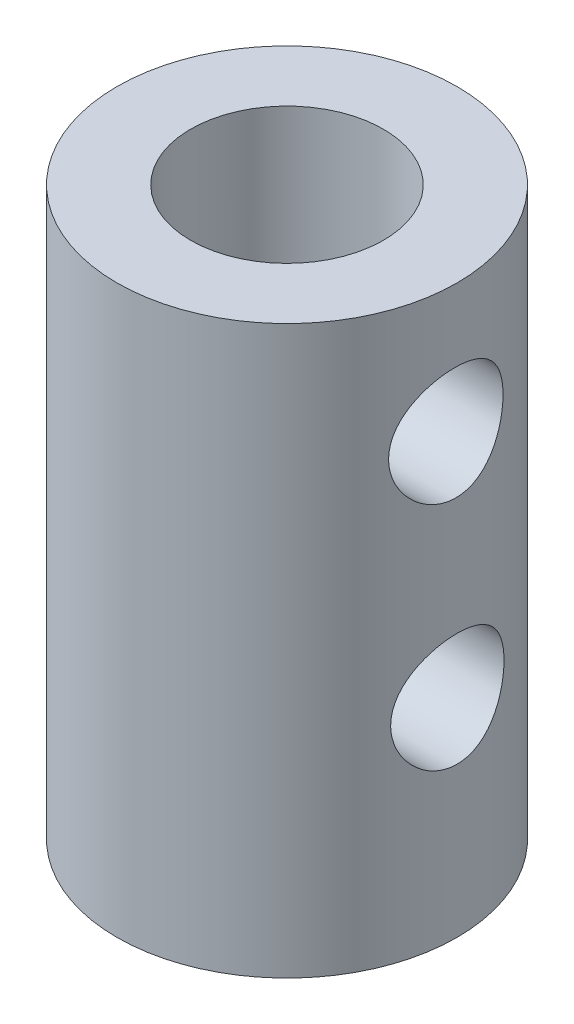
ISO-10303-21;
HEADER;
FILE_DESCRIPTION(('STEP AP214'),'2;1');
FILE_NAME('part.step','',(''),(''),'','','');
FILE_SCHEMA(('AUTOMOTIVE_DESIGN { 1 0 10303 214 1 1 1 1 }'));
ENDSEC;
DATA;
#1=APPLICATION_CONTEXT('core data for automotive mechanical design processes');
#2=APPLICATION_PROTOCOL_DEFINITION('international standard','automotive_design',2000,#1);
#3=PRODUCT_CONTEXT('',#1,'mechanical');
#4=PRODUCT('Part','Part','',(#3));
#5=PRODUCT_RELATED_PRODUCT_CATEGORY('part','',(#4));
#6=PRODUCT_DEFINITION_FORMATION('','',#4);
#7=PRODUCT_DEFINITION_CONTEXT('part definition',#1,'design');
#8=PRODUCT_DEFINITION('design','',#6,#7);
#9=PRODUCT_DEFINITION_SHAPE('','',#8);
#10=(LENGTH_UNIT() NAMED_UNIT(*) SI_UNIT(.MILLI.,.METRE.));
#11=(NAMED_UNIT(*) PLANE_ANGLE_UNIT() SI_UNIT($,.RADIAN.));
#12=(NAMED_UNIT(*) SI_UNIT($,.STERADIAN.) SOLID_ANGLE_UNIT());
#13=UNCERTAINTY_MEASURE_WITH_UNIT(LENGTH_MEASURE(1.E-05),#10,'distance_accuracy_value','');
#14=(GEOMETRIC_REPRESENTATION_CONTEXT(3) GLOBAL_UNCERTAINTY_ASSIGNED_CONTEXT((#13)) GLOBAL_UNIT_ASSIGNED_CONTEXT((#10,
#11,#12)) REPRESENTATION_CONTEXT('',''));
#15=CARTESIAN_POINT('',(0.,0.,0.));
#16=DIRECTION('',(0.,0.,1.));
#17=DIRECTION('',(1.,0.,0.));
#18=AXIS2_PLACEMENT_3D('',#15,#16,#17);
#19=CARTESIAN_POINT('',(0.,20.,0.));
#20=DIRECTION('',(0.,-1.,0.));
#21=DIRECTION('',(0.,0.,-1.));
#22=AXIS2_PLACEMENT_3D('',#19,#20,#21);
#23=CYLINDRICAL_SURFACE('',#22,6.);
#24=CARTESIAN_POINT('',(5.65685424949238,7.29207964004125,2.));
#25=CARTESIAN_POINT('',(5.65685389060868,7.4010159897134,2.00000051589543));
#26=CARTESIAN_POINT('',(5.66003538581715,7.50994923968844,1.99106956737105));
#27=CARTESIAN_POINT('',(5.6723514816251,7.72458848202975,1.95570226337762));
#28=CARTESIAN_POINT('',(5.68148706284378,7.83029393978619,1.92926302433679));
#29=CARTESIAN_POINT('',(5.70456407377583,8.03533342603583,1.85991097136981));
#30=CARTESIAN_POINT('',(5.71849607942644,8.13467949892668,1.81703044280649));
#31=CARTESIAN_POINT('',(5.74958244020649,8.32479973713717,1.71612325688276));
#32=CARTESIAN_POINT('',(5.76673750607225,8.41557200514851,1.65809325772037));
#33=CARTESIAN_POINT('',(5.80308978814946,8.58951956471788,1.52610229288576));
#34=CARTESIAN_POINT('',(5.82233789689288,8.67231049738471,1.45164868275584));
#35=CARTESIAN_POINT('',(5.86027729602006,8.82449324249053,1.28997533442879));
#36=CARTESIAN_POINT('',(5.87896849657923,8.89388290320599,1.20275355010475));
#37=CARTESIAN_POINT('',(5.91427733843598,9.01903743470044,1.01520901593002));
#38=CARTESIAN_POINT('',(5.93082815403211,9.07439958127717,0.914603822449051));
#39=CARTESIAN_POINT('',(5.95939173541966,9.16726281029627,0.704862445974949));
#40=CARTESIAN_POINT('',(5.97140572406004,9.20476870639506,0.595728571374425));
#41=CARTESIAN_POINT('',(5.98918150863813,9.25955134930604,0.37605763486699));
#42=CARTESIAN_POINT('',(5.99514629555118,9.27748653255527,0.265701509705938));
#43=CARTESIAN_POINT('',(6.00087216436496,9.29471222676257,0.0433957496481802));
#44=CARTESIAN_POINT('',(6.00063484525791,9.29400754334608,-0.0685534670877913));
#45=CARTESIAN_POINT('',(5.99412079237463,9.2743911309092,-0.286207030387628));
#46=CARTESIAN_POINT('',(5.98808129510235,9.25619458309228,-0.391984097183312));
#47=CARTESIAN_POINT('',(5.97093934679463,9.20329367808031,-0.598886877644342));
#48=CARTESIAN_POINT('',(5.95983655262364,9.1685882020816,-0.70001227555843));
#49=CARTESIAN_POINT('',(5.93351340586449,9.08323700542913,-0.896304949683944));
#50=CARTESIAN_POINT('',(5.91824085048031,9.03238776294823,-0.991376441937689));
#51=CARTESIAN_POINT('',(5.88516786077838,8.91636022914394,-1.17184865105464));
#52=CARTESIAN_POINT('',(5.86736672402934,8.85117795338599,-1.25724666877068));
#53=CARTESIAN_POINT('',(5.83012383699793,8.70473085312186,-1.42020173310261));
#54=CARTESIAN_POINT('',(5.81064430337755,8.62285332435829,-1.49720031413054));
#55=CARTESIAN_POINT('',(5.77294670497801,8.44718218858802,-1.63655451919635));
#56=CARTESIAN_POINT('',(5.75472883491231,8.35338674858517,-1.69890788656309));
#57=CARTESIAN_POINT('',(5.72141050242225,8.15477238883437,-1.80797491007149));
#58=CARTESIAN_POINT('',(5.70635818569496,8.04981537740571,-1.85445292724268));
#59=CARTESIAN_POINT('',(5.6816330164877,7.83293685161242,-1.92888638653867));
#60=CARTESIAN_POINT('',(5.67195790974186,7.72101827762876,-1.95684959149499));
#61=CARTESIAN_POINT('',(5.6595927263117,7.4988029292181,-1.99232256419504));
#62=CARTESIAN_POINT('',(5.65660720637512,7.38866079054394,-2.00069819101527));
#63=CARTESIAN_POINT('',(5.65713344118369,7.16852734181304,-1.99921087781944));
#64=CARTESIAN_POINT('',(5.66064401583629,7.05853600799328,-1.98935125045353));
#65=CARTESIAN_POINT('',(5.67347236180599,6.84576570861744,-1.95245130310462));
#66=CARTESIAN_POINT('',(5.68258650881681,6.74286877973957,-1.92601278796137));
#67=CARTESIAN_POINT('',(5.70537107342046,6.54299242756289,-1.85742772512093));
#68=CARTESIAN_POINT('',(5.71904229869679,6.44601405685969,-1.81527839272684));
#69=CARTESIAN_POINT('',(5.74993755191574,6.25731879834726,-1.71494868147787));
#70=CARTESIAN_POINT('',(5.76726051331257,6.16586635475765,-1.65630223671699));
#71=CARTESIAN_POINT('',(5.80331537461931,5.99378753527382,-1.52517126111512));
#72=CARTESIAN_POINT('',(5.82204768887589,5.91316436271881,-1.45268265099756));
#73=CARTESIAN_POINT('',(5.85990077275698,5.76102367185998,-1.29178341180065));
#74=CARTESIAN_POINT('',(5.87899687155793,5.69013086000355,-1.20277454109331));
#75=CARTESIAN_POINT('',(5.91453703226218,5.56424735534517,-1.01365458280051));
#76=CARTESIAN_POINT('',(5.9309811883539,5.5092560977164,-0.913543889729105));
#77=CARTESIAN_POINT('',(5.95928811621206,5.41723943031782,-0.705559724864592));
#78=CARTESIAN_POINT('',(5.97118060009062,5.38009708574512,-0.597742246642394));
#79=CARTESIAN_POINT('',(5.98917221675549,5.32462415592104,-0.376916931692034));
#80=CARTESIAN_POINT('',(5.99527344068038,5.30628678028025,-0.26391098390778));
#81=CARTESIAN_POINT('',(6.00083726472513,5.28955548482997,-0.0416306717200827));
#82=CARTESIAN_POINT('',(6.00059840178878,5.2902647321765,0.0675694478400361));
#83=CARTESIAN_POINT('',(5.99424393038796,5.30939425633407,0.284222290000347));
#84=CARTESIAN_POINT('',(5.98812879867152,5.32781309634679,0.391675153638113));
#85=CARTESIAN_POINT('',(5.97081829908825,5.38124410919318,0.600084238864116));
#86=CARTESIAN_POINT('',(5.95970516722297,5.41598807074712,0.701116541825576));
#87=CARTESIAN_POINT('',(5.9335432140899,5.50083470223556,0.895956701879589));
#88=CARTESIAN_POINT('',(5.91849368096033,5.55094015043528,0.989763248284863));
#89=CARTESIAN_POINT('',(5.88531737655762,5.66721866424527,1.17126803261757));
#90=CARTESIAN_POINT('',(5.86709744983853,5.73391701080453,1.25861250311521));
#91=CARTESIAN_POINT('',(5.82985977583759,5.88059442235364,1.42116205254485));
#92=CARTESIAN_POINT('',(5.81084177546194,5.96057772456671,1.49636324324918));
#93=CARTESIAN_POINT('',(5.77326559651197,6.13529835121515,1.63548361766623));
#94=CARTESIAN_POINT('',(5.75475455977261,6.23049066199453,1.6988459319958));
#95=CARTESIAN_POINT('',(5.72120386646031,6.43074849384681,1.80862868660223));
#96=CARTESIAN_POINT('',(5.70616330322499,6.53581142610058,1.85505355363895));
#97=CARTESIAN_POINT('',(5.68202668413029,6.74800328807252,1.92768765640833));
#98=CARTESIAN_POINT('',(5.67269265714364,6.85482416709199,1.95471581829904));
#99=CARTESIAN_POINT('',(5.66010767079037,7.07179174097466,1.99086864029853));
#100=CARTESIAN_POINT('',(5.65685461234923,7.18193727486267,1.99999947839318));
#101=CARTESIAN_POINT('',(5.65685424949238,7.29207964004125,2.));
#102=B_SPLINE_CURVE_WITH_KNOTS('',3,(#24,#25,#26,#27,#28,#29,#30,#31,#32,#33,#34,#35,#36,#37,
#38,#39,#40,#41,#42,#43,#44,#45,#46,#47,#48,#49,#50,#51,#52,#53,#54,#55,#56,#57,#58,#59,#60,#61,
#62,#63,#64,#65,#66,#67,#68,#69,#70,#71,#72,#73,#74,#75,#76,#77,#78,#79,#80,#81,#82,#83,#84,#85,
#86,#87,#88,#89,#90,#91,#92,#93,#94,#95,#96,#97,#98,#99,#100,#101),.UNSPECIFIED.,.T.,.F.,(4,2,2,
2,2,2,2,2,2,2,2,2,2,2,2,2,2,2,2,2,2,2,2,2,2,2,2,2,2,2,2,2,2,2,2,2,2,2,4),(0.,0.326401169598711,
0.652856110030327,0.978673255001653,1.30456233237088,1.64202674855136,1.97954530343976,
2.32587012287314,2.67210152773578,3.00628637529868,3.34038506604654,3.66138009651138,
3.98239688378473,4.3076330972067,4.63295983748044,4.97360348727835,5.31429959224212,
5.65985279686111,6.00526102713231,6.33508582728879,6.66485071674467,6.98328791537552,
7.30178158293891,7.6303771547143,7.95906971324255,8.30357616342185,8.64807037515065,
8.99027582381703,9.33235766008313,9.65836169355271,9.98433928019562,10.3051391208086,
10.6259970152649,10.9587103904127,11.2915300886526,11.6373780547229,11.9831355653373,
12.3132642432538,12.6432789438093),.UNSPECIFIED.);
#103=CARTESIAN_POINT('',(5.65685424949238,7.29207964004125,2.));
#104=VERTEX_POINT('',#103);
#105=EDGE_CURVE('E75',#104,#104,#102,.T.);
#106=ORIENTED_EDGE('',*,*,#105,.T.);
#107=EDGE_LOOP('',(#106));
#108=FACE_BOUND('',#107,.T.);
#109=CARTESIAN_POINT('',(5.63740957335227,15.4521873129121,2.05416973550781));
#110=CARTESIAN_POINT('',(5.63740918004511,15.5608968055005,2.0541702947415));
#111=CARTESIAN_POINT('',(5.64067409681087,15.6696029692319,2.04527597329984));
#112=CARTESIAN_POINT('',(5.65331781960119,15.8837876750583,2.01005959718403));
#113=CARTESIAN_POINT('',(5.66269767886371,15.9892656578541,1.98373454022696));
#114=CARTESIAN_POINT('',(5.68640820217683,16.1938488187528,1.91470049961461));
#115=CARTESIAN_POINT('',(5.70072868998288,16.2929666031599,1.872025172903));
#116=CARTESIAN_POINT('',(5.7327235176911,16.4826626122997,1.77162280853658));
#117=CARTESIAN_POINT('',(5.75039861625731,16.5732388983751,1.71389236497579));
#118=CARTESIAN_POINT('',(5.78796805020909,16.7470069466819,1.58248445242397));
#119=CARTESIAN_POINT('',(5.80792059544388,16.8297968790088,1.50829217529393));
#120=CARTESIAN_POINT('',(5.84739259160611,16.9820348770356,1.34717179907507));
#121=CARTESIAN_POINT('',(5.86691196496878,17.0514805700657,1.26024143992851));
#122=CARTESIAN_POINT('',(5.90406608441203,17.1770116295527,1.07301430415939));
#123=CARTESIAN_POINT('',(5.92162960253291,17.2326502322779,0.972402574328418));
#124=CARTESIAN_POINT('',(5.95228705145154,17.3260491768487,0.762562355467496));
#125=CARTESIAN_POINT('',(5.96538215540636,17.3638142123083,0.653336137408898));
#126=CARTESIAN_POINT('',(5.98531622079326,17.4190795346293,0.433320802877348));
#127=CARTESIAN_POINT('',(5.99235402311321,17.4372293554401,0.322713225692161));
#128=CARTESIAN_POINT('',(6.00020497465471,17.4547869893212,0.0998133323327878));
#129=CARTESIAN_POINT('',(6.00101982922095,17.4541999372968,-0.012478513829691));
#130=CARTESIAN_POINT('',(5.99651820644245,17.4347080534088,-0.230628489586211));
#131=CARTESIAN_POINT('',(5.99145366820093,17.4165610651518,-0.336560747366104));
#132=CARTESIAN_POINT('',(5.97620886736972,17.363694263697,-0.543810445174909));
#133=CARTESIAN_POINT('',(5.96602831844331,17.3289735228925,-0.645127626557582));
#134=CARTESIAN_POINT('',(5.94152337041775,17.2436319877015,-0.841551241860483));
#135=CARTESIAN_POINT('',(5.92715652916941,17.1928478617672,-0.93658117784661));
#136=CARTESIAN_POINT('',(5.89582240335895,17.0769579391426,-1.11699355142995));
#137=CARTESIAN_POINT('',(5.87885442318398,17.011848309403,-1.20237339769733));
#138=CARTESIAN_POINT('',(5.84324193383276,16.8656516382249,-1.36520748304793));
#139=CARTESIAN_POINT('',(5.82455622177566,16.7839685323478,-1.44211825487414));
#140=CARTESIAN_POINT('',(5.78831085807304,16.60874368618,-1.581343038101));
#141=CARTESIAN_POINT('',(5.77075138339816,16.5152000890391,-1.64365475954959));
#142=CARTESIAN_POINT('',(5.73856052427096,16.3170204463969,-1.75277580933977));
#143=CARTESIAN_POINT('',(5.72397910590186,16.2122340891359,-1.79932806287823));
#144=CARTESIAN_POINT('',(5.6999865838408,15.995724650958,-1.87395493088595));
#145=CARTESIAN_POINT('',(5.69057346977223,15.8840042860932,-1.90203673086919));
#146=CARTESIAN_POINT('',(5.67847225737652,15.661822999687,-1.93785905918261));
#147=CARTESIAN_POINT('',(5.67551822858495,15.5515063720196,-1.94640464079312));
#148=CARTESIAN_POINT('',(5.67593294380995,15.3309970255528,-1.94519609411734));
#149=CARTESIAN_POINT('',(5.67930057859492,15.2208042884096,-1.93544517622906));
#150=CARTESIAN_POINT('',(5.69169922458701,15.007448732699,-1.89866029917739));
#151=CARTESIAN_POINT('',(5.7005404038265,14.9041738984047,-1.87220508538968));
#152=CARTESIAN_POINT('',(5.72265916814267,14.7035466272868,-1.80345969125856));
#153=CARTESIAN_POINT('',(5.7359375190395,14.6061952162294,-1.76116677730329));
#154=CARTESIAN_POINT('',(5.76589800159988,14.416932783909,-1.66049677015591));
#155=CARTESIAN_POINT('',(5.78267047239423,14.3252733538804,-1.60167429941454));
#156=CARTESIAN_POINT('',(5.81750869799993,14.1528224485496,-1.47010746540146));
#157=CARTESIAN_POINT('',(5.83557481617414,14.0720340452196,-1.3973591809358));
#158=CARTESIAN_POINT('',(5.87189833502831,13.9198524115192,-1.23609568872456));
#159=CARTESIAN_POINT('',(5.89012756471093,13.8490478212541,-1.14701703620512));
#160=CARTESIAN_POINT('',(5.92383995603937,13.7233565317246,-0.957780203717378));
#161=CARTESIAN_POINT('',(5.93932325921365,13.668469011982,-0.857622595204469));
#162=CARTESIAN_POINT('',(5.96562380907466,13.5767517823293,-0.649771270517007));
#163=CARTESIAN_POINT('',(5.97647887542608,13.539775359174,-0.542147333789661));
#164=CARTESIAN_POINT('',(5.99238106748697,13.4845640402992,-0.321792295860902));
#165=CARTESIAN_POINT('',(5.99743023810752,13.4663225461388,-0.209063007379335));
#166=CARTESIAN_POINT('',(6.00096448893496,13.4496694721637,0.0127204727588702));
#167=CARTESIAN_POINT('',(5.99974082273043,13.4503843466133,0.121705195249284));
#168=CARTESIAN_POINT('',(5.99145496877637,13.4694422914076,0.337885372763223));
#169=CARTESIAN_POINT('',(5.9843931741162,13.4877841749147,0.445080947756818));
#170=CARTESIAN_POINT('',(5.96523873357521,13.5410327329569,0.653235451183811));
#171=CARTESIAN_POINT('',(5.95321467069417,13.575714467414,0.754258639181144));
#172=CARTESIAN_POINT('',(5.9252813780359,13.6604171750846,0.94907093135861));
#173=CARTESIAN_POINT('',(5.90937140850447,13.7104410694263,1.04285865365542));
#174=CARTESIAN_POINT('',(5.87447509205043,13.8266502806857,1.22451308080622));
#175=CARTESIAN_POINT('',(5.85539312240391,13.8933887589321,1.31200734507826));
#176=CARTESIAN_POINT('',(5.81651716478836,14.0401941988234,1.47483858831758));
#177=CARTESIAN_POINT('',(5.79672294459027,14.1202655390845,1.55017155736035));
#178=CARTESIAN_POINT('',(5.75768135415747,14.2952320524679,1.68954289718536));
#179=CARTESIAN_POINT('',(5.73848586476246,14.3905853919087,1.75302253280242));
#180=CARTESIAN_POINT('',(5.7037354597404,14.5912373079121,1.86299339094055));
#181=CARTESIAN_POINT('',(5.68817950086237,14.6965330223723,1.9094894838487));
#182=CARTESIAN_POINT('',(5.66329221167576,14.9088355763785,1.98205168982837));
#183=CARTESIAN_POINT('',(5.65369366854577,15.0155068912264,2.00900573495722));
#184=CARTESIAN_POINT('',(5.64075368707276,15.2321831966039,2.04506122592361));
#185=CARTESIAN_POINT('',(5.63740997132972,15.3421869589494,2.05416916963356));
#186=CARTESIAN_POINT('',(5.63740957335227,15.4521873129121,2.05416973550781));
#187=B_SPLINE_CURVE_WITH_KNOTS('',3,(#109,#110,#111,#112,#113,#114,#115,#116,#117,#118,#119,
#120,#121,#122,#123,#124,#125,#126,#127,#128,#129,#130,#131,#132,#133,#134,#135,#136,#137,#138,
#139,#140,#141,#142,#143,#144,#145,#146,#147,#148,#149,#150,#151,#152,#153,#154,#155,#156,#157,
#158,#159,#160,#161,#162,#163,#164,#165,#166,#167,#168,#169,#170,#171,#172,#173,#174,#175,#176,
#177,#178,#179,#180,#181,#182,#183,#184,#185,#186),.UNSPECIFIED.,.T.,.F.,(4,2,2,2,2,2,2,2,2,2,2,
2,2,2,2,2,2,2,2,2,2,2,2,2,2,2,2,2,2,2,2,2,2,2,2,2,2,2,4),(0.,0.325720160025991,
0.651496436934689,0.976605677190446,1.30178853052679,1.63910919452346,1.97648978036302,
2.32367206452072,2.67076312765901,3.00597089541703,3.34108679910556,3.66235661419975,
3.9836444123654,4.30831015760037,4.63306287893689,4.97271768672452,5.31242573587055,
5.65743465762279,6.00230928191386,6.33269425900636,6.66302127047066,6.98248828500956,
7.30201046548985,7.63113991668867,7.96036217997663,8.30444407567064,8.64850823180068,
8.98970432099702,9.33078019969986,9.65616717654179,9.98153224640709,10.3025435590821,
10.6236160298944,10.9571828949898,11.2908595228957,11.6376206829761,11.9842823238045,
12.3139902903897,12.6435781860052),.UNSPECIFIED.);
#188=CARTESIAN_POINT('',(5.63740957335227,15.4521873129121,2.05416973550781));
#189=VERTEX_POINT('',#188);
#190=EDGE_CURVE('E108',#189,#189,#187,.T.);
#191=ORIENTED_EDGE('',*,*,#190,.T.);
#192=EDGE_LOOP('',(#191));
#193=FACE_BOUND('',#192,.T.);
#194=CARTESIAN_POINT('',(0.,20.,0.));
#195=DIRECTION('',(0.,1.,0.));
#196=DIRECTION('',(0.,0.,1.));
#197=AXIS2_PLACEMENT_3D('',#194,#195,#196);
#198=CIRCLE('',#197,6.);
#199=CARTESIAN_POINT('',(0.,20.,6.));
#200=VERTEX_POINT('',#199);
#201=EDGE_CURVE('E87',#200,#200,#198,.T.);
#202=ORIENTED_EDGE('',*,*,#201,.F.);
#203=EDGE_LOOP('',(#202));
#204=FACE_BOUND('',#203,.T.);
#205=CARTESIAN_POINT('',(0.,0.,0.));
#206=DIRECTION('',(0.,1.,0.));
#207=DIRECTION('',(0.,0.,1.));
#208=AXIS2_PLACEMENT_3D('',#205,#206,#207);
#209=CIRCLE('',#208,6.);
#210=CARTESIAN_POINT('',(0.,0.,6.));
#211=VERTEX_POINT('',#210);
#212=EDGE_CURVE('E90',#211,#211,#209,.T.);
#213=ORIENTED_EDGE('',*,*,#212,.T.);
#214=EDGE_LOOP('',(#213));
#215=FACE_BOUND('',#214,.T.);
#216=ADVANCED_FACE('F33',(#108,#193,#204,#215),#23,.T.);
#217=CARTESIAN_POINT('',(0.,20.,0.));
#218=DIRECTION('',(0.,1.,0.));
#219=DIRECTION('',(0.,0.,1.));
#220=AXIS2_PLACEMENT_3D('',#217,#218,#219);
#221=PLANE('',#220);
#222=CARTESIAN_POINT('',(0.,20.,0.));
#223=DIRECTION('',(0.,1.,0.));
#224=DIRECTION('',(0.,0.,1.));
#225=AXIS2_PLACEMENT_3D('',#222,#223,#224);
#226=CIRCLE('',#225,3.4);
#227=CARTESIAN_POINT('',(0.,20.,3.4));
#228=VERTEX_POINT('',#227);
#229=EDGE_CURVE('E97',#228,#228,#226,.T.);
#230=ORIENTED_EDGE('',*,*,#229,.F.);
#231=EDGE_LOOP('',(#230));
#232=FACE_BOUND('',#231,.T.);
#233=ORIENTED_EDGE('',*,*,#201,.T.);
#234=EDGE_LOOP('',(#233));
#235=FACE_BOUND('',#234,.T.);
#236=ADVANCED_FACE('F136',(#232,#235),#221,.T.);
#237=CARTESIAN_POINT('',(0.,0.,0.));
#238=DIRECTION('',(0.,1.,0.));
#239=DIRECTION('',(0.,0.,1.));
#240=AXIS2_PLACEMENT_3D('',#237,#238,#239);
#241=PLANE('',#240);
#242=ORIENTED_EDGE('',*,*,#212,.F.);
#243=EDGE_LOOP('',(#242));
#244=FACE_BOUND('',#243,.T.);
#245=ADVANCED_FACE('F135',(#244),#241,.F.);
#246=CARTESIAN_POINT('',(0.,6.45,0.));
#247=DIRECTION('',(0.,1.,0.));
#248=DIRECTION('',(0.,0.,1.));
#249=AXIS2_PLACEMENT_3D('',#246,#247,#248);
#250=CYLINDRICAL_SURFACE('',#249,3.4);
#251=CARTESIAN_POINT('',(0.,18.26,0.));
#252=DIRECTION('',(0.,-1.,0.));
#253=DIRECTION('',(0.,0.,-1.));
#254=AXIS2_PLACEMENT_3D('',#251,#252,#253);
#255=CIRCLE('',#254,3.4);
#256=CARTESIAN_POINT('',(2.6,18.26,2.19089023002066));
#257=VERTEX_POINT('',#256);
#258=CARTESIAN_POINT('',(2.6,18.26,-2.19089023002066));
#259=VERTEX_POINT('',#258);
#260=EDGE_CURVE('E41',#257,#259,#255,.F.);
#261=ORIENTED_EDGE('',*,*,#260,.F.);
#262=DIRECTION('',(0.,1.,0.));
#263=VECTOR('',#262,1.);
#264=CARTESIAN_POINT('',(2.6,6.45,2.19089023002067));
#265=LINE('',#264,#263);
#266=CARTESIAN_POINT('',(2.6,6.45,2.19089023002066));
#267=VERTEX_POINT('',#266);
#268=EDGE_CURVE('E100',#257,#267,#265,.F.);
#269=ORIENTED_EDGE('',*,*,#268,.T.);
#270=CARTESIAN_POINT('',(0.,6.45,0.));
#271=DIRECTION('',(0.,1.,0.));
#272=DIRECTION('',(0.,0.,1.));
#273=AXIS2_PLACEMENT_3D('',#270,#271,#272);
#274=CIRCLE('',#273,3.4);
#275=CARTESIAN_POINT('',(2.6,6.45,-2.19089023002066));
#276=VERTEX_POINT('',#275);
#277=EDGE_CURVE('E95',#276,#267,#274,.T.);
#278=ORIENTED_EDGE('',*,*,#277,.F.);
#279=DIRECTION('',(0.,1.,0.));
#280=VECTOR('',#279,1.);
#281=CARTESIAN_POINT('',(2.6,6.45,-2.19089023002067));
#282=LINE('',#281,#280);
#283=EDGE_CURVE('E54',#276,#259,#282,.T.);
#284=ORIENTED_EDGE('',*,*,#283,.T.);
#285=EDGE_LOOP('',(#261,#269,#278,#284));
#286=FACE_BOUND('',#285,.T.);
#287=ORIENTED_EDGE('',*,*,#229,.T.);
#288=EDGE_LOOP('',(#287));
#289=FACE_BOUND('',#288,.T.);
#290=ADVANCED_FACE('F132',(#286,#289),#250,.F.);
#291=CARTESIAN_POINT('',(0.,6.45,0.));
#292=DIRECTION('',(0.,1.,0.));
#293=DIRECTION('',(0.,0.,1.));
#294=AXIS2_PLACEMENT_3D('',#291,#292,#293);
#295=PLANE('',#294);
#296=DIRECTION('',(0.,0.,1.));
#297=VECTOR('',#296,1.);
#298=CARTESIAN_POINT('',(2.6,6.45,0.));
#299=LINE('',#298,#297);
#300=CARTESIAN_POINT('',(2.6,6.45,-1.81408430890849));
#301=VERTEX_POINT('',#300);
#302=EDGE_CURVE('E80',#276,#301,#299,.T.);
#303=ORIENTED_EDGE('',*,*,#302,.F.);
#304=ORIENTED_EDGE('',*,*,#277,.T.);
#305=CARTESIAN_POINT('',(2.6,6.45,1.81408430890849));
#306=VERTEX_POINT('',#305);
#307=EDGE_CURVE('E81',#306,#267,#299,.T.);
#308=ORIENTED_EDGE('',*,*,#307,.F.);
#309=EDGE_CURVE('E74',#301,#306,#299,.T.);
#310=ORIENTED_EDGE('',*,*,#309,.F.);
#311=EDGE_LOOP('',(#303,#304,#308,#310));
#312=FACE_BOUND('',#311,.T.);
#313=ADVANCED_FACE('F78',(#312),#295,.T.);
#314=CARTESIAN_POINT('',(0.,18.26,0.));
#315=DIRECTION('',(0.,-1.,0.));
#316=DIRECTION('',(0.,0.,-1.));
#317=AXIS2_PLACEMENT_3D('',#314,#315,#316);
#318=PLANE('',#317);
#319=DIRECTION('',(0.,0.,1.));
#320=VECTOR('',#319,1.);
#321=CARTESIAN_POINT('',(2.6,18.26,3.57158819939229));
#322=LINE('',#321,#320);
#323=EDGE_CURVE('E105',#259,#257,#322,.T.);
#324=ORIENTED_EDGE('',*,*,#323,.T.);
#325=ORIENTED_EDGE('',*,*,#260,.T.);
#326=EDGE_LOOP('',(#324,#325));
#327=FACE_BOUND('',#326,.T.);
#328=ADVANCED_FACE('F124',(#327),#318,.F.);
#329=CARTESIAN_POINT('',(2.6,4.71,3.57158819939229));
#330=DIRECTION('',(-1.,0.,0.));
#331=DIRECTION('',(0.,0.,1.));
#332=AXIS2_PLACEMENT_3D('',#329,#330,#331);
#333=PLANE('',#332);
#334=CARTESIAN_POINT('',(2.6,7.29207964004125,0.));
#335=DIRECTION('',(-1.,0.,0.));
#336=DIRECTION('',(0.,0.,1.));
#337=AXIS2_PLACEMENT_3D('',#334,#335,#336);
#338=CIRCLE('',#337,2.);
#339=EDGE_CURVE('E11',#306,#301,#338,.T.);
#340=ORIENTED_EDGE('',*,*,#339,.F.);
#341=ORIENTED_EDGE('',*,*,#307,.T.);
#342=ORIENTED_EDGE('',*,*,#268,.F.);
#343=ORIENTED_EDGE('',*,*,#323,.F.);
#344=ORIENTED_EDGE('',*,*,#283,.F.);
#345=ORIENTED_EDGE('',*,*,#302,.T.);
#346=EDGE_LOOP('',(#340,#341,#342,#343,#344,#345));
#347=FACE_BOUND('',#346,.T.);
#348=CARTESIAN_POINT('',(2.6,15.4521873129121,0.0541697355078124));
#349=DIRECTION('',(-1.,0.,0.));
#350=DIRECTION('',(0.,0.,1.));
#351=AXIS2_PLACEMENT_3D('',#348,#349,#350);
#352=CIRCLE('',#351,2.);
#353=CARTESIAN_POINT('',(2.6,15.4521873129121,2.05416973550781));
#354=VERTEX_POINT('',#353);
#355=EDGE_CURVE('E114',#354,#354,#352,.T.);
#356=ORIENTED_EDGE('',*,*,#355,.F.);
#357=EDGE_LOOP('',(#356));
#358=FACE_BOUND('',#357,.T.);
#359=ADVANCED_FACE('F83',(#347,#358),#333,.T.);
#360=CARTESIAN_POINT('',(16.15,15.4521873129121,0.0541697355078124));
#361=DIRECTION('',(-1.,0.,0.));
#362=DIRECTION('',(0.,0.,1.));
#363=AXIS2_PLACEMENT_3D('',#360,#361,#362);
#364=CYLINDRICAL_SURFACE('',#363,2.);
#365=ORIENTED_EDGE('',*,*,#355,.T.);
#366=EDGE_LOOP('',(#365));
#367=FACE_BOUND('',#366,.T.);
#368=ORIENTED_EDGE('',*,*,#190,.F.);
#369=EDGE_LOOP('',(#368));
#370=FACE_BOUND('',#369,.T.);
#371=ADVANCED_FACE('F116',(#367,#370),#364,.F.);
#372=CARTESIAN_POINT('',(16.15,7.29207964004125,0.));
#373=DIRECTION('',(-1.,0.,0.));
#374=DIRECTION('',(0.,0.,1.));
#375=AXIS2_PLACEMENT_3D('',#372,#373,#374);
#376=CYLINDRICAL_SURFACE('',#375,2.);
#377=CARTESIAN_POINT('',(2.6,7.29207964004125,0.));
#378=DIRECTION('',(-1.,0.,0.));
#379=DIRECTION('',(0.,0.,1.));
#380=AXIS2_PLACEMENT_3D('',#377,#378,#379);
#381=CIRCLE('',#380,2.);
#382=EDGE_CURVE('E46',#301,#306,#381,.T.);
#383=ORIENTED_EDGE('',*,*,#382,.T.);
#384=ORIENTED_EDGE('',*,*,#339,.T.);
#385=EDGE_LOOP('',(#383,#384));
#386=FACE_BOUND('',#385,.T.);
#387=ORIENTED_EDGE('',*,*,#105,.F.);
#388=EDGE_LOOP('',(#387));
#389=FACE_BOUND('',#388,.T.);
#390=ADVANCED_FACE('F66',(#386,#389),#376,.F.);
#391=CARTESIAN_POINT('',(2.6,7.29207964004125,0.));
#392=DIRECTION('',(-1.,0.,0.));
#393=DIRECTION('',(0.,0.,1.));
#394=AXIS2_PLACEMENT_3D('',#391,#392,#393);
#395=PLANE('',#394);
#396=ORIENTED_EDGE('',*,*,#309,.T.);
#397=ORIENTED_EDGE('',*,*,#382,.F.);
#398=EDGE_LOOP('',(#396,#397));
#399=FACE_BOUND('',#398,.T.);
#400=ADVANCED_FACE('F73',(#399),#395,.F.);
#401=CLOSED_SHELL('',(#216,#236,#245,#290,#313,#328,#359,#371,#390,#400));
#402=MANIFOLD_SOLID_BREP('B2',#401);
#403=ADVANCED_BREP_SHAPE_REPRESENTATION('',(#18,#402),#14);
#404=SHAPE_DEFINITION_REPRESENTATION(#9,#403);
ENDSEC;
END-ISO-10303-21;
